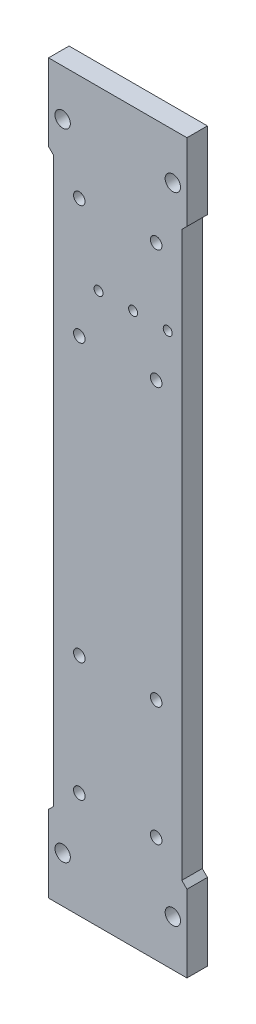
ISO-10303-21;
HEADER;
FILE_DESCRIPTION(('STEP AP214'),'2;1');
FILE_NAME('part.step','',(''),(''),'','','');
FILE_SCHEMA(('AUTOMOTIVE_DESIGN { 1 0 10303 214 1 1 1 1 }'));
ENDSEC;
DATA;
#1=APPLICATION_CONTEXT('core data for automotive mechanical design processes');
#2=APPLICATION_PROTOCOL_DEFINITION('international standard','automotive_design',2000,#1);
#3=PRODUCT_CONTEXT('',#1,'mechanical');
#4=PRODUCT('Part','Part','',(#3));
#5=PRODUCT_RELATED_PRODUCT_CATEGORY('part','',(#4));
#6=PRODUCT_DEFINITION_FORMATION('','',#4);
#7=PRODUCT_DEFINITION_CONTEXT('part definition',#1,'design');
#8=PRODUCT_DEFINITION('design','',#6,#7);
#9=PRODUCT_DEFINITION_SHAPE('','',#8);
#10=(LENGTH_UNIT() NAMED_UNIT(*) SI_UNIT(.MILLI.,.METRE.));
#11=(NAMED_UNIT(*) PLANE_ANGLE_UNIT() SI_UNIT($,.RADIAN.));
#12=(NAMED_UNIT(*) SI_UNIT($,.STERADIAN.) SOLID_ANGLE_UNIT());
#13=UNCERTAINTY_MEASURE_WITH_UNIT(LENGTH_MEASURE(1.E-05),#10,'distance_accuracy_value','');
#14=(GEOMETRIC_REPRESENTATION_CONTEXT(3) GLOBAL_UNCERTAINTY_ASSIGNED_CONTEXT((#13)) GLOBAL_UNIT_ASSIGNED_CONTEXT((#10,
#11,#12)) REPRESENTATION_CONTEXT('',''));
#15=CARTESIAN_POINT('',(0.,0.,0.));
#16=DIRECTION('',(0.,0.,1.));
#17=DIRECTION('',(1.,0.,0.));
#18=AXIS2_PLACEMENT_3D('',#15,#16,#17);
#19=CARTESIAN_POINT('',(50.,0.,8.));
#20=DIRECTION('',(-1.,0.,0.));
#21=DIRECTION('',(0.,0.,1.));
#22=AXIS2_PLACEMENT_3D('',#19,#20,#21);
#23=PLANE('',#22);
#24=DIRECTION('',(0.,1.,0.));
#25=VECTOR('',#24,1.);
#26=CARTESIAN_POINT('',(50.,0.,8.));
#27=LINE('',#26,#25);
#28=CARTESIAN_POINT('',(50.,32.,8.));
#29=VERTEX_POINT('',#28);
#30=CARTESIAN_POINT('',(50.,252.,8.));
#31=VERTEX_POINT('',#30);
#32=EDGE_CURVE('E212',#29,#31,#27,.T.);
#33=ORIENTED_EDGE('',*,*,#32,.F.);
#34=DIRECTION('',(0.,0.,-1.));
#35=VECTOR('',#34,1.);
#36=CARTESIAN_POINT('',(50.,32.,8.));
#37=LINE('',#36,#35);
#38=CARTESIAN_POINT('',(50.,32.,0.));
#39=VERTEX_POINT('',#38);
#40=EDGE_CURVE('E227',#29,#39,#37,.T.);
#41=ORIENTED_EDGE('',*,*,#40,.T.);
#42=DIRECTION('',(0.,1.,0.));
#43=VECTOR('',#42,1.);
#44=CARTESIAN_POINT('',(50.,0.,0.));
#45=LINE('',#44,#43);
#46=CARTESIAN_POINT('',(50.,252.,0.));
#47=VERTEX_POINT('',#46);
#48=EDGE_CURVE('E221',#39,#47,#45,.T.);
#49=ORIENTED_EDGE('',*,*,#48,.T.);
#50=DIRECTION('',(0.,0.,1.));
#51=VECTOR('',#50,1.);
#52=CARTESIAN_POINT('',(50.,252.,8.));
#53=LINE('',#52,#51);
#54=EDGE_CURVE('E217',#47,#31,#53,.T.);
#55=ORIENTED_EDGE('',*,*,#54,.T.);
#56=EDGE_LOOP('',(#33,#41,#49,#55));
#57=FACE_BOUND('',#56,.T.);
#58=ADVANCED_FACE('F32',(#57),#23,.F.);
#59=CARTESIAN_POINT('',(0.,0.,8.));
#60=DIRECTION('',(1.,0.,0.));
#61=DIRECTION('',(0.,0.,-1.));
#62=AXIS2_PLACEMENT_3D('',#59,#60,#61);
#63=PLANE('',#62);
#64=DIRECTION('',(0.,-1.,0.));
#65=VECTOR('',#64,1.);
#66=CARTESIAN_POINT('',(0.,0.,0.));
#67=LINE('',#66,#65);
#68=CARTESIAN_POINT('',(0.,252.,0.));
#69=VERTEX_POINT('',#68);
#70=CARTESIAN_POINT('',(0.,32.0000000000001,0.));
#71=VERTEX_POINT('',#70);
#72=EDGE_CURVE('E125',#69,#71,#67,.T.);
#73=ORIENTED_EDGE('',*,*,#72,.T.);
#74=DIRECTION('',(0.,0.,1.));
#75=VECTOR('',#74,1.);
#76=CARTESIAN_POINT('',(0.,32.0000000000001,8.));
#77=LINE('',#76,#75);
#78=CARTESIAN_POINT('',(0.,32.0000000000001,8.));
#79=VERTEX_POINT('',#78);
#80=EDGE_CURVE('E230',#71,#79,#77,.T.);
#81=ORIENTED_EDGE('',*,*,#80,.T.);
#82=DIRECTION('',(0.,-1.,0.));
#83=VECTOR('',#82,1.);
#84=CARTESIAN_POINT('',(0.,0.,8.));
#85=LINE('',#84,#83);
#86=CARTESIAN_POINT('',(0.,252.,8.));
#87=VERTEX_POINT('',#86);
#88=EDGE_CURVE('E206',#87,#79,#85,.T.);
#89=ORIENTED_EDGE('',*,*,#88,.F.);
#90=DIRECTION('',(0.,0.,-1.));
#91=VECTOR('',#90,1.);
#92=CARTESIAN_POINT('',(0.,252.,8.));
#93=LINE('',#92,#91);
#94=EDGE_CURVE('E54',#87,#69,#93,.T.);
#95=ORIENTED_EDGE('',*,*,#94,.T.);
#96=EDGE_LOOP('',(#73,#81,#89,#95));
#97=FACE_BOUND('',#96,.T.);
#98=ADVANCED_FACE('F270',(#97),#63,.F.);
#99=CARTESIAN_POINT('',(0.,0.,8.));
#100=DIRECTION('',(0.,1.,0.));
#101=DIRECTION('',(0.,0.,1.));
#102=AXIS2_PLACEMENT_3D('',#99,#100,#101);
#103=PLANE('',#102);
#104=DIRECTION('',(1.,0.,0.));
#105=VECTOR('',#104,1.);
#106=CARTESIAN_POINT('',(0.,0.,0.));
#107=LINE('',#106,#105);
#108=CARTESIAN_POINT('',(-2.,0.,0.));
#109=VERTEX_POINT('',#108);
#110=CARTESIAN_POINT('',(52.,0.,0.));
#111=VERTEX_POINT('',#110);
#112=EDGE_CURVE('E219',#109,#111,#107,.T.);
#113=ORIENTED_EDGE('',*,*,#112,.T.);
#114=DIRECTION('',(0.,0.,1.));
#115=VECTOR('',#114,1.);
#116=CARTESIAN_POINT('',(52.,0.,0.));
#117=LINE('',#116,#115);
#118=CARTESIAN_POINT('',(52.,0.,8.));
#119=VERTEX_POINT('',#118);
#120=EDGE_CURVE('E165',#111,#119,#117,.T.);
#121=ORIENTED_EDGE('',*,*,#120,.T.);
#122=DIRECTION('',(1.,0.,0.));
#123=VECTOR('',#122,1.);
#124=CARTESIAN_POINT('',(0.,0.,8.));
#125=LINE('',#124,#123);
#126=CARTESIAN_POINT('',(-2.,0.,8.));
#127=VERTEX_POINT('',#126);
#128=EDGE_CURVE('E209',#127,#119,#125,.T.);
#129=ORIENTED_EDGE('',*,*,#128,.F.);
#130=DIRECTION('',(0.,0.,1.));
#131=VECTOR('',#130,1.);
#132=CARTESIAN_POINT('',(-2.,0.,0.));
#133=LINE('',#132,#131);
#134=EDGE_CURVE('E177',#109,#127,#133,.T.);
#135=ORIENTED_EDGE('',*,*,#134,.F.);
#136=EDGE_LOOP('',(#113,#121,#129,#135));
#137=FACE_BOUND('',#136,.T.);
#138=ADVANCED_FACE('F264',(#137),#103,.F.);
#139=CARTESIAN_POINT('',(0.,284.,8.));
#140=DIRECTION('',(0.,-1.,0.));
#141=DIRECTION('',(0.,0.,-1.));
#142=AXIS2_PLACEMENT_3D('',#139,#140,#141);
#143=PLANE('',#142);
#144=DIRECTION('',(-1.,0.,0.));
#145=VECTOR('',#144,1.);
#146=CARTESIAN_POINT('',(0.,284.,0.));
#147=LINE('',#146,#145);
#148=CARTESIAN_POINT('',(52.,284.,0.));
#149=VERTEX_POINT('',#148);
#150=CARTESIAN_POINT('',(-2.,284.,0.));
#151=VERTEX_POINT('',#150);
#152=EDGE_CURVE('E210',#149,#151,#147,.T.);
#153=ORIENTED_EDGE('',*,*,#152,.T.);
#154=DIRECTION('',(0.,0.,1.));
#155=VECTOR('',#154,1.);
#156=CARTESIAN_POINT('',(-2.,284.,0.));
#157=LINE('',#156,#155);
#158=CARTESIAN_POINT('',(-2.,284.,8.));
#159=VERTEX_POINT('',#158);
#160=EDGE_CURVE('E138',#151,#159,#157,.T.);
#161=ORIENTED_EDGE('',*,*,#160,.T.);
#162=DIRECTION('',(-1.,0.,0.));
#163=VECTOR('',#162,1.);
#164=CARTESIAN_POINT('',(0.,284.,8.));
#165=LINE('',#164,#163);
#166=CARTESIAN_POINT('',(52.,284.,8.));
#167=VERTEX_POINT('',#166);
#168=EDGE_CURVE('E215',#167,#159,#165,.T.);
#169=ORIENTED_EDGE('',*,*,#168,.F.);
#170=DIRECTION('',(0.,0.,1.));
#171=VECTOR('',#170,1.);
#172=CARTESIAN_POINT('',(52.,284.,0.));
#173=LINE('',#172,#171);
#174=EDGE_CURVE('E153',#149,#167,#173,.T.);
#175=ORIENTED_EDGE('',*,*,#174,.F.);
#176=EDGE_LOOP('',(#153,#161,#169,#175));
#177=FACE_BOUND('',#176,.T.);
#178=ADVANCED_FACE('F351',(#177),#143,.F.);
#179=CARTESIAN_POINT('',(0.,0.,8.));
#180=DIRECTION('',(0.,0.,-1.));
#181=DIRECTION('',(-1.,0.,0.));
#182=AXIS2_PLACEMENT_3D('',#179,#180,#181);
#183=PLANE('',#182);
#184=CARTESIAN_POINT('',(31.,215.,8.));
#185=DIRECTION('',(0.,0.,1.));
#186=DIRECTION('',(1.,0.,0.));
#187=AXIS2_PLACEMENT_3D('',#184,#185,#186);
#188=CIRCLE('',#187,1.75);
#189=CARTESIAN_POINT('',(32.75,215.,8.));
#190=VERTEX_POINT('',#189);
#191=EDGE_CURVE('E334',#190,#190,#188,.T.);
#192=ORIENTED_EDGE('',*,*,#191,.F.);
#193=EDGE_LOOP('',(#192));
#194=FACE_BOUND('',#193,.T.);
#195=CARTESIAN_POINT('',(17.5,215.,8.));
#196=DIRECTION('',(0.,0.,1.));
#197=DIRECTION('',(-1.,0.,0.));
#198=AXIS2_PLACEMENT_3D('',#195,#196,#197);
#199=CIRCLE('',#198,1.75);
#200=CARTESIAN_POINT('',(15.75,215.,8.));
#201=VERTEX_POINT('',#200);
#202=EDGE_CURVE('E328',#201,#201,#199,.T.);
#203=ORIENTED_EDGE('',*,*,#202,.F.);
#204=EDGE_LOOP('',(#203));
#205=FACE_BOUND('',#204,.T.);
#206=CARTESIAN_POINT('',(44.5,215.,8.));
#207=DIRECTION('',(0.,0.,1.));
#208=DIRECTION('',(1.,0.,0.));
#209=AXIS2_PLACEMENT_3D('',#206,#207,#208);
#210=CIRCLE('',#209,1.75);
#211=CARTESIAN_POINT('',(46.25,215.,8.));
#212=VERTEX_POINT('',#211);
#213=EDGE_CURVE('E322',#212,#212,#210,.T.);
#214=ORIENTED_EDGE('',*,*,#213,.F.);
#215=EDGE_LOOP('',(#214));
#216=FACE_BOUND('',#215,.T.);
#217=CARTESIAN_POINT('',(10.,88.,8.));
#218=DIRECTION('',(0.,0.,1.));
#219=DIRECTION('',(1.,0.,0.));
#220=AXIS2_PLACEMENT_3D('',#217,#218,#219);
#221=CIRCLE('',#220,2.25);
#222=CARTESIAN_POINT('',(12.25,88.,8.));
#223=VERTEX_POINT('',#222);
#224=EDGE_CURVE('E317',#223,#223,#221,.T.);
#225=ORIENTED_EDGE('',*,*,#224,.F.);
#226=EDGE_LOOP('',(#225));
#227=FACE_BOUND('',#226,.T.);
#228=CARTESIAN_POINT('',(40.,88.,8.));
#229=DIRECTION('',(0.,0.,1.));
#230=DIRECTION('',(-1.,0.,0.));
#231=AXIS2_PLACEMENT_3D('',#228,#229,#230);
#232=CIRCLE('',#231,2.25000000000001);
#233=CARTESIAN_POINT('',(37.75,88.,8.));
#234=VERTEX_POINT('',#233);
#235=EDGE_CURVE('E311',#234,#234,#232,.T.);
#236=ORIENTED_EDGE('',*,*,#235,.F.);
#237=EDGE_LOOP('',(#236));
#238=FACE_BOUND('',#237,.T.);
#239=CARTESIAN_POINT('',(40.,41.5,8.));
#240=DIRECTION('',(0.,0.,1.));
#241=DIRECTION('',(-1.,0.,0.));
#242=AXIS2_PLACEMENT_3D('',#239,#240,#241);
#243=CIRCLE('',#242,2.25);
#244=CARTESIAN_POINT('',(37.75,41.5,8.));
#245=VERTEX_POINT('',#244);
#246=EDGE_CURVE('E305',#245,#245,#243,.T.);
#247=ORIENTED_EDGE('',*,*,#246,.F.);
#248=EDGE_LOOP('',(#247));
#249=FACE_BOUND('',#248,.T.);
#250=CARTESIAN_POINT('',(40.,242.5,8.));
#251=DIRECTION('',(0.,0.,1.));
#252=DIRECTION('',(1.,0.,0.));
#253=AXIS2_PLACEMENT_3D('',#250,#251,#252);
#254=CIRCLE('',#253,2.25);
#255=CARTESIAN_POINT('',(42.25,242.5,8.));
#256=VERTEX_POINT('',#255);
#257=EDGE_CURVE('E299',#256,#256,#254,.T.);
#258=ORIENTED_EDGE('',*,*,#257,.F.);
#259=EDGE_LOOP('',(#258));
#260=FACE_BOUND('',#259,.T.);
#261=CARTESIAN_POINT('',(40.,196.,8.));
#262=DIRECTION('',(0.,0.,1.));
#263=DIRECTION('',(1.,0.,0.));
#264=AXIS2_PLACEMENT_3D('',#261,#262,#263);
#265=CIRCLE('',#264,2.25000000000001);
#266=CARTESIAN_POINT('',(42.25,196.,8.));
#267=VERTEX_POINT('',#266);
#268=EDGE_CURVE('E293',#267,#267,#265,.T.);
#269=ORIENTED_EDGE('',*,*,#268,.F.);
#270=EDGE_LOOP('',(#269));
#271=FACE_BOUND('',#270,.T.);
#272=CARTESIAN_POINT('',(9.99999999999998,196.,8.));
#273=DIRECTION('',(0.,0.,1.));
#274=DIRECTION('',(-1.,0.,0.));
#275=AXIS2_PLACEMENT_3D('',#272,#273,#274);
#276=CIRCLE('',#275,2.25);
#277=CARTESIAN_POINT('',(7.74999999999998,196.,8.));
#278=VERTEX_POINT('',#277);
#279=EDGE_CURVE('E287',#278,#278,#276,.T.);
#280=ORIENTED_EDGE('',*,*,#279,.F.);
#281=EDGE_LOOP('',(#280));
#282=FACE_BOUND('',#281,.T.);
#283=CARTESIAN_POINT('',(9.99999999999996,242.5,8.));
#284=DIRECTION('',(0.,0.,1.));
#285=DIRECTION('',(-1.,0.,0.));
#286=AXIS2_PLACEMENT_3D('',#283,#284,#285);
#287=CIRCLE('',#286,2.25);
#288=CARTESIAN_POINT('',(7.74999999999996,242.5,8.));
#289=VERTEX_POINT('',#288);
#290=EDGE_CURVE('E280',#289,#289,#287,.T.);
#291=ORIENTED_EDGE('',*,*,#290,.F.);
#292=EDGE_LOOP('',(#291));
#293=FACE_BOUND('',#292,.T.);
#294=CARTESIAN_POINT('',(10.,41.5,8.));
#295=DIRECTION('',(0.,0.,1.));
#296=DIRECTION('',(1.,0.,0.));
#297=AXIS2_PLACEMENT_3D('',#294,#295,#296);
#298=CIRCLE('',#297,2.25);
#299=CARTESIAN_POINT('',(12.25,41.5,8.));
#300=VERTEX_POINT('',#299);
#301=EDGE_CURVE('E274',#300,#300,#298,.T.);
#302=ORIENTED_EDGE('',*,*,#301,.F.);
#303=EDGE_LOOP('',(#302));
#304=FACE_BOUND('',#303,.T.);
#305=CARTESIAN_POINT('',(46.5,18.,8.));
#306=DIRECTION('',(0.,0.,1.));
#307=DIRECTION('',(-1.,0.,0.));
#308=AXIS2_PLACEMENT_3D('',#305,#306,#307);
#309=CIRCLE('',#308,3.);
#310=CARTESIAN_POINT('',(43.5,18.,8.));
#311=VERTEX_POINT('',#310);
#312=EDGE_CURVE('E187',#311,#311,#309,.T.);
#313=ORIENTED_EDGE('',*,*,#312,.F.);
#314=EDGE_LOOP('',(#313));
#315=FACE_BOUND('',#314,.T.);
#316=CARTESIAN_POINT('',(46.5,266.,8.));
#317=DIRECTION('',(0.,0.,1.));
#318=DIRECTION('',(1.,0.,0.));
#319=AXIS2_PLACEMENT_3D('',#316,#317,#318);
#320=CIRCLE('',#319,3.);
#321=CARTESIAN_POINT('',(49.5,266.,8.));
#322=VERTEX_POINT('',#321);
#323=EDGE_CURVE('E193',#322,#322,#320,.T.);
#324=ORIENTED_EDGE('',*,*,#323,.F.);
#325=EDGE_LOOP('',(#324));
#326=FACE_BOUND('',#325,.T.);
#327=CARTESIAN_POINT('',(3.49999999999997,266.,8.));
#328=DIRECTION('',(0.,0.,1.));
#329=DIRECTION('',(-1.,0.,0.));
#330=AXIS2_PLACEMENT_3D('',#327,#328,#329);
#331=CIRCLE('',#330,3.);
#332=CARTESIAN_POINT('',(0.499999999999966,266.,8.));
#333=VERTEX_POINT('',#332);
#334=EDGE_CURVE('E180',#333,#333,#331,.T.);
#335=ORIENTED_EDGE('',*,*,#334,.F.);
#336=EDGE_LOOP('',(#335));
#337=FACE_BOUND('',#336,.T.);
#338=CARTESIAN_POINT('',(3.5,18.,8.));
#339=DIRECTION('',(0.,0.,1.));
#340=DIRECTION('',(1.,0.,0.));
#341=AXIS2_PLACEMENT_3D('',#338,#339,#340);
#342=CIRCLE('',#341,3.);
#343=CARTESIAN_POINT('',(6.5,18.,8.));
#344=VERTEX_POINT('',#343);
#345=EDGE_CURVE('E186',#344,#344,#342,.T.);
#346=ORIENTED_EDGE('',*,*,#345,.F.);
#347=EDGE_LOOP('',(#346));
#348=FACE_BOUND('',#347,.T.);
#349=ORIENTED_EDGE('',*,*,#168,.T.);
#350=DIRECTION('',(0.,-1.,0.));
#351=VECTOR('',#350,1.);
#352=CARTESIAN_POINT('',(-2.,254.,8.));
#353=LINE('',#352,#351);
#354=CARTESIAN_POINT('',(-2.,254.,8.));
#355=VERTEX_POINT('',#354);
#356=EDGE_CURVE('E139',#159,#355,#353,.T.);
#357=ORIENTED_EDGE('',*,*,#356,.T.);
#358=DIRECTION('',(0.707106781186557,-0.707106781186538,0.));
#359=VECTOR('',#358,1.);
#360=CARTESIAN_POINT('',(126.,126.000000000003,8.));
#361=LINE('',#360,#359);
#362=EDGE_CURVE('E128',#355,#87,#361,.T.);
#363=ORIENTED_EDGE('',*,*,#362,.T.);
#364=ORIENTED_EDGE('',*,*,#88,.T.);
#365=DIRECTION('',(-0.707106781186543,-0.707106781186552,0.));
#366=VECTOR('',#365,1.);
#367=CARTESIAN_POINT('',(-16.,15.9999999999998,8.));
#368=LINE('',#367,#366);
#369=CARTESIAN_POINT('',(-2.,30.,8.));
#370=VERTEX_POINT('',#369);
#371=EDGE_CURVE('E237',#79,#370,#368,.T.);
#372=ORIENTED_EDGE('',*,*,#371,.T.);
#373=DIRECTION('',(0.,-1.,0.));
#374=VECTOR('',#373,1.);
#375=CARTESIAN_POINT('',(-2.,30.,8.));
#376=LINE('',#375,#374);
#377=EDGE_CURVE('E168',#370,#127,#376,.T.);
#378=ORIENTED_EDGE('',*,*,#377,.T.);
#379=ORIENTED_EDGE('',*,*,#128,.T.);
#380=DIRECTION('',(0.,1.,0.));
#381=VECTOR('',#380,1.);
#382=CARTESIAN_POINT('',(52.,30.,8.));
#383=LINE('',#382,#381);
#384=CARTESIAN_POINT('',(52.,30.,8.));
#385=VERTEX_POINT('',#384);
#386=EDGE_CURVE('E156',#119,#385,#383,.T.);
#387=ORIENTED_EDGE('',*,*,#386,.T.);
#388=DIRECTION('',(-0.707106781186548,0.707106781186548,0.));
#389=VECTOR('',#388,1.);
#390=CARTESIAN_POINT('',(41.,41.,8.));
#391=LINE('',#390,#389);
#392=EDGE_CURVE('E233',#385,#29,#391,.T.);
#393=ORIENTED_EDGE('',*,*,#392,.T.);
#394=ORIENTED_EDGE('',*,*,#32,.T.);
#395=DIRECTION('',(0.707106781186548,0.707106781186548,0.));
#396=VECTOR('',#395,1.);
#397=CARTESIAN_POINT('',(-101.,101.,8.));
#398=LINE('',#397,#396);
#399=CARTESIAN_POINT('',(52.,254.,8.));
#400=VERTEX_POINT('',#399);
#401=EDGE_CURVE('E40',#31,#400,#398,.T.);
#402=ORIENTED_EDGE('',*,*,#401,.T.);
#403=DIRECTION('',(0.,1.,0.));
#404=VECTOR('',#403,1.);
#405=CARTESIAN_POINT('',(52.,254.,8.));
#406=LINE('',#405,#404);
#407=EDGE_CURVE('E143',#400,#167,#406,.T.);
#408=ORIENTED_EDGE('',*,*,#407,.T.);
#409=EDGE_LOOP('',(#349,#357,#363,#364,#372,#378,#379,#387,#393,#394,#402,#408));
#410=FACE_BOUND('',#409,.T.);
#411=ADVANCED_FACE('F242',(#194,#205,#216,#227,#238,#249,#260,#271,#282,#293,#304,#315,#326,
#337,#348,#410),#183,.F.);
#412=CARTESIAN_POINT('',(0.,0.,0.));
#413=DIRECTION('',(0.,0.,-1.));
#414=DIRECTION('',(-1.,0.,0.));
#415=AXIS2_PLACEMENT_3D('',#412,#413,#414);
#416=PLANE('',#415);
#417=CARTESIAN_POINT('',(31.,215.,0.));
#418=DIRECTION('',(0.,0.,1.));
#419=DIRECTION('',(1.,0.,0.));
#420=AXIS2_PLACEMENT_3D('',#417,#418,#419);
#421=CIRCLE('',#420,1.75);
#422=CARTESIAN_POINT('',(32.75,215.,0.));
#423=VERTEX_POINT('',#422);
#424=EDGE_CURVE('E325',#423,#423,#421,.T.);
#425=ORIENTED_EDGE('',*,*,#424,.T.);
#426=EDGE_LOOP('',(#425));
#427=FACE_BOUND('',#426,.T.);
#428=CARTESIAN_POINT('',(17.5,215.,0.));
#429=DIRECTION('',(0.,0.,1.));
#430=DIRECTION('',(-1.,0.,0.));
#431=AXIS2_PLACEMENT_3D('',#428,#429,#430);
#432=CIRCLE('',#431,1.75);
#433=CARTESIAN_POINT('',(15.75,215.,0.));
#434=VERTEX_POINT('',#433);
#435=EDGE_CURVE('E331',#434,#434,#432,.T.);
#436=ORIENTED_EDGE('',*,*,#435,.T.);
#437=EDGE_LOOP('',(#436));
#438=FACE_BOUND('',#437,.T.);
#439=CARTESIAN_POINT('',(44.5,215.,0.));
#440=DIRECTION('',(0.,0.,1.));
#441=DIRECTION('',(1.,0.,0.));
#442=AXIS2_PLACEMENT_3D('',#439,#440,#441);
#443=CIRCLE('',#442,1.75);
#444=CARTESIAN_POINT('',(46.25,215.,0.));
#445=VERTEX_POINT('',#444);
#446=EDGE_CURVE('E284',#445,#445,#443,.T.);
#447=ORIENTED_EDGE('',*,*,#446,.T.);
#448=EDGE_LOOP('',(#447));
#449=FACE_BOUND('',#448,.T.);
#450=CARTESIAN_POINT('',(10.,88.,0.));
#451=DIRECTION('',(0.,0.,1.));
#452=DIRECTION('',(1.,0.,0.));
#453=AXIS2_PLACEMENT_3D('',#450,#451,#452);
#454=CIRCLE('',#453,2.25);
#455=CARTESIAN_POINT('',(12.25,88.,0.));
#456=VERTEX_POINT('',#455);
#457=EDGE_CURVE('E278',#456,#456,#454,.T.);
#458=ORIENTED_EDGE('',*,*,#457,.T.);
#459=EDGE_LOOP('',(#458));
#460=FACE_BOUND('',#459,.T.);
#461=CARTESIAN_POINT('',(40.,88.,0.));
#462=DIRECTION('',(0.,0.,1.));
#463=DIRECTION('',(-1.,0.,0.));
#464=AXIS2_PLACEMENT_3D('',#461,#462,#463);
#465=CIRCLE('',#464,2.25000000000001);
#466=CARTESIAN_POINT('',(37.75,88.,0.));
#467=VERTEX_POINT('',#466);
#468=EDGE_CURVE('E314',#467,#467,#465,.T.);
#469=ORIENTED_EDGE('',*,*,#468,.T.);
#470=EDGE_LOOP('',(#469));
#471=FACE_BOUND('',#470,.T.);
#472=CARTESIAN_POINT('',(40.,41.5,0.));
#473=DIRECTION('',(0.,0.,1.));
#474=DIRECTION('',(-1.,0.,0.));
#475=AXIS2_PLACEMENT_3D('',#472,#473,#474);
#476=CIRCLE('',#475,2.25);
#477=CARTESIAN_POINT('',(37.75,41.5,0.));
#478=VERTEX_POINT('',#477);
#479=EDGE_CURVE('E308',#478,#478,#476,.T.);
#480=ORIENTED_EDGE('',*,*,#479,.T.);
#481=EDGE_LOOP('',(#480));
#482=FACE_BOUND('',#481,.T.);
#483=CARTESIAN_POINT('',(40.,242.5,0.));
#484=DIRECTION('',(0.,0.,1.));
#485=DIRECTION('',(1.,0.,0.));
#486=AXIS2_PLACEMENT_3D('',#483,#484,#485);
#487=CIRCLE('',#486,2.25);
#488=CARTESIAN_POINT('',(42.25,242.5,0.));
#489=VERTEX_POINT('',#488);
#490=EDGE_CURVE('E302',#489,#489,#487,.T.);
#491=ORIENTED_EDGE('',*,*,#490,.T.);
#492=EDGE_LOOP('',(#491));
#493=FACE_BOUND('',#492,.T.);
#494=CARTESIAN_POINT('',(40.,196.,0.));
#495=DIRECTION('',(0.,0.,1.));
#496=DIRECTION('',(1.,0.,0.));
#497=AXIS2_PLACEMENT_3D('',#494,#495,#496);
#498=CIRCLE('',#497,2.25000000000001);
#499=CARTESIAN_POINT('',(42.25,196.,0.));
#500=VERTEX_POINT('',#499);
#501=EDGE_CURVE('E296',#500,#500,#498,.T.);
#502=ORIENTED_EDGE('',*,*,#501,.T.);
#503=EDGE_LOOP('',(#502));
#504=FACE_BOUND('',#503,.T.);
#505=CARTESIAN_POINT('',(9.99999999999998,196.,0.));
#506=DIRECTION('',(0.,0.,1.));
#507=DIRECTION('',(-1.,0.,0.));
#508=AXIS2_PLACEMENT_3D('',#505,#506,#507);
#509=CIRCLE('',#508,2.25);
#510=CARTESIAN_POINT('',(7.74999999999998,196.,0.));
#511=VERTEX_POINT('',#510);
#512=EDGE_CURVE('E290',#511,#511,#509,.T.);
#513=ORIENTED_EDGE('',*,*,#512,.T.);
#514=EDGE_LOOP('',(#513));
#515=FACE_BOUND('',#514,.T.);
#516=CARTESIAN_POINT('',(9.99999999999996,242.5,0.));
#517=DIRECTION('',(0.,0.,1.));
#518=DIRECTION('',(-1.,0.,0.));
#519=AXIS2_PLACEMENT_3D('',#516,#517,#518);
#520=CIRCLE('',#519,2.25);
#521=CARTESIAN_POINT('',(7.74999999999996,242.5,0.));
#522=VERTEX_POINT('',#521);
#523=EDGE_CURVE('E283',#522,#522,#520,.T.);
#524=ORIENTED_EDGE('',*,*,#523,.T.);
#525=EDGE_LOOP('',(#524));
#526=FACE_BOUND('',#525,.T.);
#527=CARTESIAN_POINT('',(10.,41.5,0.));
#528=DIRECTION('',(0.,0.,1.));
#529=DIRECTION('',(1.,0.,0.));
#530=AXIS2_PLACEMENT_3D('',#527,#528,#529);
#531=CIRCLE('',#530,2.25);
#532=CARTESIAN_POINT('',(12.25,41.5,0.));
#533=VERTEX_POINT('',#532);
#534=EDGE_CURVE('E272',#533,#533,#531,.T.);
#535=ORIENTED_EDGE('',*,*,#534,.T.);
#536=EDGE_LOOP('',(#535));
#537=FACE_BOUND('',#536,.T.);
#538=CARTESIAN_POINT('',(46.5,18.,0.));
#539=DIRECTION('',(0.,0.,1.));
#540=DIRECTION('',(-1.,0.,0.));
#541=AXIS2_PLACEMENT_3D('',#538,#539,#540);
#542=CIRCLE('',#541,3.);
#543=CARTESIAN_POINT('',(43.5,18.,0.));
#544=VERTEX_POINT('',#543);
#545=EDGE_CURVE('E183',#544,#544,#542,.T.);
#546=ORIENTED_EDGE('',*,*,#545,.T.);
#547=EDGE_LOOP('',(#546));
#548=FACE_BOUND('',#547,.T.);
#549=CARTESIAN_POINT('',(46.5,266.,0.));
#550=DIRECTION('',(0.,0.,1.));
#551=DIRECTION('',(1.,0.,0.));
#552=AXIS2_PLACEMENT_3D('',#549,#550,#551);
#553=CIRCLE('',#552,3.);
#554=CARTESIAN_POINT('',(49.5,266.,0.));
#555=VERTEX_POINT('',#554);
#556=EDGE_CURVE('E190',#555,#555,#553,.T.);
#557=ORIENTED_EDGE('',*,*,#556,.T.);
#558=EDGE_LOOP('',(#557));
#559=FACE_BOUND('',#558,.T.);
#560=CARTESIAN_POINT('',(3.49999999999997,266.,0.));
#561=DIRECTION('',(0.,0.,1.));
#562=DIRECTION('',(-1.,0.,0.));
#563=AXIS2_PLACEMENT_3D('',#560,#561,#562);
#564=CIRCLE('',#563,3.);
#565=CARTESIAN_POINT('',(0.499999999999966,266.,0.));
#566=VERTEX_POINT('',#565);
#567=EDGE_CURVE('E196',#566,#566,#564,.T.);
#568=ORIENTED_EDGE('',*,*,#567,.T.);
#569=EDGE_LOOP('',(#568));
#570=FACE_BOUND('',#569,.T.);
#571=CARTESIAN_POINT('',(3.5,18.,0.));
#572=DIRECTION('',(0.,0.,1.));
#573=DIRECTION('',(1.,0.,0.));
#574=AXIS2_PLACEMENT_3D('',#571,#572,#573);
#575=CIRCLE('',#574,3.);
#576=CARTESIAN_POINT('',(6.5,18.,0.));
#577=VERTEX_POINT('',#576);
#578=EDGE_CURVE('E201',#577,#577,#575,.T.);
#579=ORIENTED_EDGE('',*,*,#578,.T.);
#580=EDGE_LOOP('',(#579));
#581=FACE_BOUND('',#580,.T.);
#582=ORIENTED_EDGE('',*,*,#72,.F.);
#583=DIRECTION('',(-0.707106781186557,0.707106781186538,0.));
#584=VECTOR('',#583,1.);
#585=CARTESIAN_POINT('',(-2.00000000000006,254.,0.));
#586=LINE('',#585,#584);
#587=CARTESIAN_POINT('',(-2.,254.,0.));
#588=VERTEX_POINT('',#587);
#589=EDGE_CURVE('E121',#69,#588,#586,.T.);
#590=ORIENTED_EDGE('',*,*,#589,.T.);
#591=DIRECTION('',(0.,-1.,0.));
#592=VECTOR('',#591,1.);
#593=CARTESIAN_POINT('',(-2.,254.,0.));
#594=LINE('',#593,#592);
#595=EDGE_CURVE('E124',#151,#588,#594,.T.);
#596=ORIENTED_EDGE('',*,*,#595,.F.);
#597=ORIENTED_EDGE('',*,*,#152,.F.);
#598=DIRECTION('',(0.,1.,0.));
#599=VECTOR('',#598,1.);
#600=CARTESIAN_POINT('',(52.,254.,0.));
#601=LINE('',#600,#599);
#602=CARTESIAN_POINT('',(52.,254.,0.));
#603=VERTEX_POINT('',#602);
#604=EDGE_CURVE('E147',#603,#149,#601,.T.);
#605=ORIENTED_EDGE('',*,*,#604,.F.);
#606=DIRECTION('',(-0.707106781186548,-0.707106781186548,0.));
#607=VECTOR('',#606,1.);
#608=CARTESIAN_POINT('',(50.,252.,0.));
#609=LINE('',#608,#607);
#610=EDGE_CURVE('E11',#603,#47,#609,.T.);
#611=ORIENTED_EDGE('',*,*,#610,.T.);
#612=ORIENTED_EDGE('',*,*,#48,.F.);
#613=DIRECTION('',(0.707106781186548,-0.707106781186548,0.));
#614=VECTOR('',#613,1.);
#615=CARTESIAN_POINT('',(52.,30.,0.));
#616=LINE('',#615,#614);
#617=CARTESIAN_POINT('',(52.,30.,0.));
#618=VERTEX_POINT('',#617);
#619=EDGE_CURVE('E235',#39,#618,#616,.T.);
#620=ORIENTED_EDGE('',*,*,#619,.T.);
#621=DIRECTION('',(0.,1.,0.));
#622=VECTOR('',#621,1.);
#623=CARTESIAN_POINT('',(52.,30.,0.));
#624=LINE('',#623,#622);
#625=EDGE_CURVE('E159',#111,#618,#624,.T.);
#626=ORIENTED_EDGE('',*,*,#625,.F.);
#627=ORIENTED_EDGE('',*,*,#112,.F.);
#628=DIRECTION('',(0.,-1.,0.));
#629=VECTOR('',#628,1.);
#630=CARTESIAN_POINT('',(-2.,30.,0.));
#631=LINE('',#630,#629);
#632=CARTESIAN_POINT('',(-2.,30.,0.));
#633=VERTEX_POINT('',#632);
#634=EDGE_CURVE('E171',#633,#109,#631,.T.);
#635=ORIENTED_EDGE('',*,*,#634,.F.);
#636=DIRECTION('',(0.707106781186543,0.707106781186552,0.));
#637=VECTOR('',#636,1.);
#638=CARTESIAN_POINT('',(0.,32.0000000000001,0.));
#639=LINE('',#638,#637);
#640=EDGE_CURVE('E47',#633,#71,#639,.T.);
#641=ORIENTED_EDGE('',*,*,#640,.T.);
#642=EDGE_LOOP('',(#582,#590,#596,#597,#605,#611,#612,#620,#626,#627,#635,#641));
#643=FACE_BOUND('',#642,.T.);
#644=ADVANCED_FACE('F123',(#427,#438,#449,#460,#471,#482,#493,#504,#515,#526,#537,#548,#559,
#570,#581,#643),#416,.T.);
#645=CARTESIAN_POINT('',(3.5,18.,0.));
#646=DIRECTION('',(0.,0.,1.));
#647=DIRECTION('',(1.,0.,0.));
#648=AXIS2_PLACEMENT_3D('',#645,#646,#647);
#649=CYLINDRICAL_SURFACE('',#648,3.);
#650=ORIENTED_EDGE('',*,*,#578,.F.);
#651=EDGE_LOOP('',(#650));
#652=FACE_BOUND('',#651,.T.);
#653=ORIENTED_EDGE('',*,*,#345,.T.);
#654=EDGE_LOOP('',(#653));
#655=FACE_BOUND('',#654,.T.);
#656=ADVANCED_FACE('F381',(#652,#655),#649,.F.);
#657=CARTESIAN_POINT('',(3.49999999999997,266.,0.));
#658=DIRECTION('',(0.,0.,1.));
#659=DIRECTION('',(1.,0.,0.));
#660=AXIS2_PLACEMENT_3D('',#657,#658,#659);
#661=CYLINDRICAL_SURFACE('',#660,3.);
#662=ORIENTED_EDGE('',*,*,#567,.F.);
#663=EDGE_LOOP('',(#662));
#664=FACE_BOUND('',#663,.T.);
#665=ORIENTED_EDGE('',*,*,#334,.T.);
#666=EDGE_LOOP('',(#665));
#667=FACE_BOUND('',#666,.T.);
#668=ADVANCED_FACE('F383',(#664,#667),#661,.F.);
#669=CARTESIAN_POINT('',(46.5,266.,0.));
#670=DIRECTION('',(0.,0.,1.));
#671=DIRECTION('',(1.,0.,0.));
#672=AXIS2_PLACEMENT_3D('',#669,#670,#671);
#673=CYLINDRICAL_SURFACE('',#672,3.);
#674=ORIENTED_EDGE('',*,*,#556,.F.);
#675=EDGE_LOOP('',(#674));
#676=FACE_BOUND('',#675,.T.);
#677=ORIENTED_EDGE('',*,*,#323,.T.);
#678=EDGE_LOOP('',(#677));
#679=FACE_BOUND('',#678,.T.);
#680=ADVANCED_FACE('F390',(#676,#679),#673,.F.);
#681=CARTESIAN_POINT('',(46.5,18.,0.));
#682=DIRECTION('',(0.,0.,1.));
#683=DIRECTION('',(1.,0.,0.));
#684=AXIS2_PLACEMENT_3D('',#681,#682,#683);
#685=CYLINDRICAL_SURFACE('',#684,3.);
#686=ORIENTED_EDGE('',*,*,#545,.F.);
#687=EDGE_LOOP('',(#686));
#688=FACE_BOUND('',#687,.T.);
#689=ORIENTED_EDGE('',*,*,#312,.T.);
#690=EDGE_LOOP('',(#689));
#691=FACE_BOUND('',#690,.T.);
#692=ADVANCED_FACE('F438',(#688,#691),#685,.F.);
#693=CARTESIAN_POINT('',(-2.,30.,0.));
#694=DIRECTION('',(-1.,0.,0.));
#695=DIRECTION('',(0.,-1.,0.));
#696=AXIS2_PLACEMENT_3D('',#693,#694,#695);
#697=PLANE('',#696);
#698=ORIENTED_EDGE('',*,*,#377,.F.);
#699=DIRECTION('',(0.,0.,1.));
#700=VECTOR('',#699,1.);
#701=CARTESIAN_POINT('',(-2.,30.,0.));
#702=LINE('',#701,#700);
#703=EDGE_CURVE('E174',#633,#370,#702,.T.);
#704=ORIENTED_EDGE('',*,*,#703,.F.);
#705=ORIENTED_EDGE('',*,*,#634,.T.);
#706=ORIENTED_EDGE('',*,*,#134,.T.);
#707=EDGE_LOOP('',(#698,#704,#705,#706));
#708=FACE_BOUND('',#707,.T.);
#709=ADVANCED_FACE('F435',(#708),#697,.T.);
#710=CARTESIAN_POINT('',(52.,30.,0.));
#711=DIRECTION('',(1.,0.,0.));
#712=DIRECTION('',(0.,0.,-1.));
#713=AXIS2_PLACEMENT_3D('',#710,#711,#712);
#714=PLANE('',#713);
#715=ORIENTED_EDGE('',*,*,#386,.F.);
#716=ORIENTED_EDGE('',*,*,#120,.F.);
#717=ORIENTED_EDGE('',*,*,#625,.T.);
#718=DIRECTION('',(0.,0.,1.));
#719=VECTOR('',#718,1.);
#720=CARTESIAN_POINT('',(52.,30.,0.));
#721=LINE('',#720,#719);
#722=EDGE_CURVE('E162',#618,#385,#721,.T.);
#723=ORIENTED_EDGE('',*,*,#722,.T.);
#724=EDGE_LOOP('',(#715,#716,#717,#723));
#725=FACE_BOUND('',#724,.T.);
#726=ADVANCED_FACE('F262',(#725),#714,.T.);
#727=CARTESIAN_POINT('',(52.,254.,0.));
#728=DIRECTION('',(1.,0.,0.));
#729=DIRECTION('',(0.,0.,-1.));
#730=AXIS2_PLACEMENT_3D('',#727,#728,#729);
#731=PLANE('',#730);
#732=ORIENTED_EDGE('',*,*,#407,.F.);
#733=DIRECTION('',(0.,0.,1.));
#734=VECTOR('',#733,1.);
#735=CARTESIAN_POINT('',(52.,254.,0.));
#736=LINE('',#735,#734);
#737=EDGE_CURVE('E150',#603,#400,#736,.T.);
#738=ORIENTED_EDGE('',*,*,#737,.F.);
#739=ORIENTED_EDGE('',*,*,#604,.T.);
#740=ORIENTED_EDGE('',*,*,#174,.T.);
#741=EDGE_LOOP('',(#732,#738,#739,#740));
#742=FACE_BOUND('',#741,.T.);
#743=ADVANCED_FACE('F247',(#742),#731,.T.);
#744=CARTESIAN_POINT('',(-2.,254.,0.));
#745=DIRECTION('',(-1.,0.,0.));
#746=DIRECTION('',(0.,-1.,0.));
#747=AXIS2_PLACEMENT_3D('',#744,#745,#746);
#748=PLANE('',#747);
#749=ORIENTED_EDGE('',*,*,#356,.F.);
#750=ORIENTED_EDGE('',*,*,#160,.F.);
#751=ORIENTED_EDGE('',*,*,#595,.T.);
#752=DIRECTION('',(0.,0.,1.));
#753=VECTOR('',#752,1.);
#754=CARTESIAN_POINT('',(-2.,254.,0.));
#755=LINE('',#754,#753);
#756=EDGE_CURVE('E135',#588,#355,#755,.T.);
#757=ORIENTED_EDGE('',*,*,#756,.T.);
#758=EDGE_LOOP('',(#749,#750,#751,#757));
#759=FACE_BOUND('',#758,.T.);
#760=ADVANCED_FACE('F134',(#759),#748,.T.);
#761=CARTESIAN_POINT('',(52.,30.,0.));
#762=DIRECTION('',(-0.707106781186547,-0.707106781186547,0.));
#763=DIRECTION('',(0.,0.,1.));
#764=AXIS2_PLACEMENT_3D('',#761,#762,#763);
#765=PLANE('',#764);
#766=ORIENTED_EDGE('',*,*,#619,.F.);
#767=ORIENTED_EDGE('',*,*,#40,.F.);
#768=ORIENTED_EDGE('',*,*,#392,.F.);
#769=ORIENTED_EDGE('',*,*,#722,.F.);
#770=EDGE_LOOP('',(#766,#767,#768,#769));
#771=FACE_BOUND('',#770,.T.);
#772=ADVANCED_FACE('F256',(#771),#765,.F.);
#773=CARTESIAN_POINT('',(0.,32.0000000000001,8.));
#774=DIRECTION('',(0.707106781186552,-0.707106781186543,0.));
#775=DIRECTION('',(0.,0.,1.));
#776=AXIS2_PLACEMENT_3D('',#773,#774,#775);
#777=PLANE('',#776);
#778=ORIENTED_EDGE('',*,*,#640,.F.);
#779=ORIENTED_EDGE('',*,*,#703,.T.);
#780=ORIENTED_EDGE('',*,*,#371,.F.);
#781=ORIENTED_EDGE('',*,*,#80,.F.);
#782=EDGE_LOOP('',(#778,#779,#780,#781));
#783=FACE_BOUND('',#782,.T.);
#784=ADVANCED_FACE('F269',(#783),#777,.F.);
#785=CARTESIAN_POINT('',(-2.00000000000006,254.,0.));
#786=DIRECTION('',(0.707106781186538,0.707106781186557,0.));
#787=DIRECTION('',(0.,0.,1.));
#788=AXIS2_PLACEMENT_3D('',#785,#786,#787);
#789=PLANE('',#788);
#790=ORIENTED_EDGE('',*,*,#589,.F.);
#791=ORIENTED_EDGE('',*,*,#94,.F.);
#792=ORIENTED_EDGE('',*,*,#362,.F.);
#793=ORIENTED_EDGE('',*,*,#756,.F.);
#794=EDGE_LOOP('',(#790,#791,#792,#793));
#795=FACE_BOUND('',#794,.T.);
#796=ADVANCED_FACE('F141',(#795),#789,.F.);
#797=CARTESIAN_POINT('',(50.,252.,8.));
#798=DIRECTION('',(-0.707106781186547,0.707106781186547,0.));
#799=DIRECTION('',(0.,0.,1.));
#800=AXIS2_PLACEMENT_3D('',#797,#798,#799);
#801=PLANE('',#800);
#802=ORIENTED_EDGE('',*,*,#610,.F.);
#803=ORIENTED_EDGE('',*,*,#737,.T.);
#804=ORIENTED_EDGE('',*,*,#401,.F.);
#805=ORIENTED_EDGE('',*,*,#54,.F.);
#806=EDGE_LOOP('',(#802,#803,#804,#805));
#807=FACE_BOUND('',#806,.T.);
#808=ADVANCED_FACE('F34',(#807),#801,.F.);
#809=CARTESIAN_POINT('',(10.,41.5,0.));
#810=DIRECTION('',(0.,0.,1.));
#811=DIRECTION('',(1.,0.,0.));
#812=AXIS2_PLACEMENT_3D('',#809,#810,#811);
#813=CYLINDRICAL_SURFACE('',#812,2.25);
#814=ORIENTED_EDGE('',*,*,#534,.F.);
#815=EDGE_LOOP('',(#814));
#816=FACE_BOUND('',#815,.T.);
#817=ORIENTED_EDGE('',*,*,#301,.T.);
#818=EDGE_LOOP('',(#817));
#819=FACE_BOUND('',#818,.T.);
#820=ADVANCED_FACE('F412',(#816,#819),#813,.F.);
#821=CARTESIAN_POINT('',(9.99999999999996,242.5,0.));
#822=DIRECTION('',(0.,0.,1.));
#823=DIRECTION('',(1.,0.,0.));
#824=AXIS2_PLACEMENT_3D('',#821,#822,#823);
#825=CYLINDRICAL_SURFACE('',#824,2.25);
#826=ORIENTED_EDGE('',*,*,#523,.F.);
#827=EDGE_LOOP('',(#826));
#828=FACE_BOUND('',#827,.T.);
#829=ORIENTED_EDGE('',*,*,#290,.T.);
#830=EDGE_LOOP('',(#829));
#831=FACE_BOUND('',#830,.T.);
#832=ADVANCED_FACE('F416',(#828,#831),#825,.F.);
#833=CARTESIAN_POINT('',(9.99999999999998,196.,0.));
#834=DIRECTION('',(0.,0.,1.));
#835=DIRECTION('',(1.,0.,0.));
#836=AXIS2_PLACEMENT_3D('',#833,#834,#835);
#837=CYLINDRICAL_SURFACE('',#836,2.25);
#838=ORIENTED_EDGE('',*,*,#512,.F.);
#839=EDGE_LOOP('',(#838));
#840=FACE_BOUND('',#839,.T.);
#841=ORIENTED_EDGE('',*,*,#279,.T.);
#842=EDGE_LOOP('',(#841));
#843=FACE_BOUND('',#842,.T.);
#844=ADVANCED_FACE('F422',(#840,#843),#837,.F.);
#845=CARTESIAN_POINT('',(40.,196.,0.));
#846=DIRECTION('',(0.,0.,1.));
#847=DIRECTION('',(1.,0.,0.));
#848=AXIS2_PLACEMENT_3D('',#845,#846,#847);
#849=CYLINDRICAL_SURFACE('',#848,2.25000000000001);
#850=ORIENTED_EDGE('',*,*,#501,.F.);
#851=EDGE_LOOP('',(#850));
#852=FACE_BOUND('',#851,.T.);
#853=ORIENTED_EDGE('',*,*,#268,.T.);
#854=EDGE_LOOP('',(#853));
#855=FACE_BOUND('',#854,.T.);
#856=ADVANCED_FACE('F512',(#852,#855),#849,.F.);
#857=CARTESIAN_POINT('',(40.,242.5,0.));
#858=DIRECTION('',(0.,0.,1.));
#859=DIRECTION('',(1.,0.,0.));
#860=AXIS2_PLACEMENT_3D('',#857,#858,#859);
#861=CYLINDRICAL_SURFACE('',#860,2.25);
#862=ORIENTED_EDGE('',*,*,#490,.F.);
#863=EDGE_LOOP('',(#862));
#864=FACE_BOUND('',#863,.T.);
#865=ORIENTED_EDGE('',*,*,#257,.T.);
#866=EDGE_LOOP('',(#865));
#867=FACE_BOUND('',#866,.T.);
#868=ADVANCED_FACE('F521',(#864,#867),#861,.F.);
#869=CARTESIAN_POINT('',(40.,41.5,0.));
#870=DIRECTION('',(0.,0.,1.));
#871=DIRECTION('',(1.,0.,0.));
#872=AXIS2_PLACEMENT_3D('',#869,#870,#871);
#873=CYLINDRICAL_SURFACE('',#872,2.25);
#874=ORIENTED_EDGE('',*,*,#479,.F.);
#875=EDGE_LOOP('',(#874));
#876=FACE_BOUND('',#875,.T.);
#877=ORIENTED_EDGE('',*,*,#246,.T.);
#878=EDGE_LOOP('',(#877));
#879=FACE_BOUND('',#878,.T.);
#880=ADVANCED_FACE('F531',(#876,#879),#873,.F.);
#881=CARTESIAN_POINT('',(40.,88.,0.));
#882=DIRECTION('',(0.,0.,1.));
#883=DIRECTION('',(1.,0.,0.));
#884=AXIS2_PLACEMENT_3D('',#881,#882,#883);
#885=CYLINDRICAL_SURFACE('',#884,2.25000000000001);
#886=ORIENTED_EDGE('',*,*,#468,.F.);
#887=EDGE_LOOP('',(#886));
#888=FACE_BOUND('',#887,.T.);
#889=ORIENTED_EDGE('',*,*,#235,.T.);
#890=EDGE_LOOP('',(#889));
#891=FACE_BOUND('',#890,.T.);
#892=ADVANCED_FACE('F541',(#888,#891),#885,.F.);
#893=CARTESIAN_POINT('',(10.,88.,0.));
#894=DIRECTION('',(0.,0.,1.));
#895=DIRECTION('',(1.,0.,0.));
#896=AXIS2_PLACEMENT_3D('',#893,#894,#895);
#897=CYLINDRICAL_SURFACE('',#896,2.25);
#898=ORIENTED_EDGE('',*,*,#457,.F.);
#899=EDGE_LOOP('',(#898));
#900=FACE_BOUND('',#899,.T.);
#901=ORIENTED_EDGE('',*,*,#224,.T.);
#902=EDGE_LOOP('',(#901));
#903=FACE_BOUND('',#902,.T.);
#904=ADVANCED_FACE('F551',(#900,#903),#897,.F.);
#905=CARTESIAN_POINT('',(44.5,215.,0.));
#906=DIRECTION('',(0.,0.,1.));
#907=DIRECTION('',(1.,0.,0.));
#908=AXIS2_PLACEMENT_3D('',#905,#906,#907);
#909=CYLINDRICAL_SURFACE('',#908,1.75);
#910=ORIENTED_EDGE('',*,*,#446,.F.);
#911=EDGE_LOOP('',(#910));
#912=FACE_BOUND('',#911,.T.);
#913=ORIENTED_EDGE('',*,*,#213,.T.);
#914=EDGE_LOOP('',(#913));
#915=FACE_BOUND('',#914,.T.);
#916=ADVANCED_FACE('F561',(#912,#915),#909,.F.);
#917=CARTESIAN_POINT('',(17.5,215.,0.));
#918=DIRECTION('',(0.,0.,1.));
#919=DIRECTION('',(1.,0.,0.));
#920=AXIS2_PLACEMENT_3D('',#917,#918,#919);
#921=CYLINDRICAL_SURFACE('',#920,1.75);
#922=ORIENTED_EDGE('',*,*,#435,.F.);
#923=EDGE_LOOP('',(#922));
#924=FACE_BOUND('',#923,.T.);
#925=ORIENTED_EDGE('',*,*,#202,.T.);
#926=EDGE_LOOP('',(#925));
#927=FACE_BOUND('',#926,.T.);
#928=ADVANCED_FACE('F345',(#924,#927),#921,.F.);
#929=CARTESIAN_POINT('',(31.,215.,0.));
#930=DIRECTION('',(0.,0.,1.));
#931=DIRECTION('',(1.,0.,0.));
#932=AXIS2_PLACEMENT_3D('',#929,#930,#931);
#933=CYLINDRICAL_SURFACE('',#932,1.75);
#934=ORIENTED_EDGE('',*,*,#424,.F.);
#935=EDGE_LOOP('',(#934));
#936=FACE_BOUND('',#935,.T.);
#937=ORIENTED_EDGE('',*,*,#191,.T.);
#938=EDGE_LOOP('',(#937));
#939=FACE_BOUND('',#938,.T.);
#940=ADVANCED_FACE('F342',(#936,#939),#933,.F.);
#941=CLOSED_SHELL('',(#58,#98,#138,#178,#411,#644,#656,#668,#680,#692,#709,#726,#743,#760,#772,
#784,#796,#808,#820,#832,#844,#856,#868,#880,#892,#904,#916,#928,#940));
#942=MANIFOLD_SOLID_BREP('B2',#941);
#943=ADVANCED_BREP_SHAPE_REPRESENTATION('',(#18,#942),#14);
#944=SHAPE_DEFINITION_REPRESENTATION(#9,#943);
ENDSEC;
END-ISO-10303-21;
